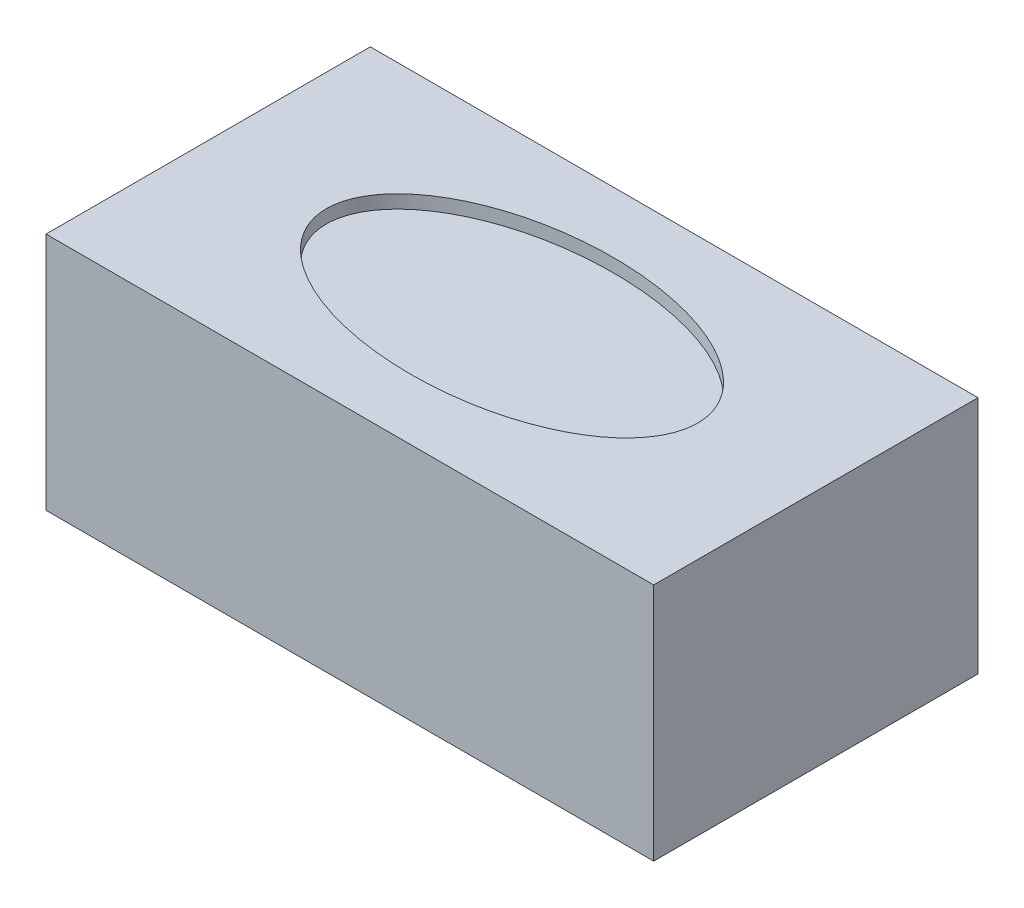
ISO-10303-21;
HEADER;
FILE_DESCRIPTION(('STEP AP214'),'2;1');
FILE_NAME('part.step','',(''),(''),'','','');
FILE_SCHEMA(('AUTOMOTIVE_DESIGN { 1 0 10303 214 1 1 1 1 }'));
ENDSEC;
DATA;
#1=APPLICATION_CONTEXT('core data for automotive mechanical design processes');
#2=APPLICATION_PROTOCOL_DEFINITION('international standard','automotive_design',2000,#1);
#3=PRODUCT_CONTEXT('',#1,'mechanical');
#4=PRODUCT('Part','Part','',(#3));
#5=PRODUCT_RELATED_PRODUCT_CATEGORY('part','',(#4));
#6=PRODUCT_DEFINITION_FORMATION('','',#4);
#7=PRODUCT_DEFINITION_CONTEXT('part definition',#1,'design');
#8=PRODUCT_DEFINITION('design','',#6,#7);
#9=PRODUCT_DEFINITION_SHAPE('','',#8);
#10=(LENGTH_UNIT() NAMED_UNIT(*) SI_UNIT(.MILLI.,.METRE.));
#11=(NAMED_UNIT(*) PLANE_ANGLE_UNIT() SI_UNIT($,.RADIAN.));
#12=(NAMED_UNIT(*) SI_UNIT($,.STERADIAN.) SOLID_ANGLE_UNIT());
#13=UNCERTAINTY_MEASURE_WITH_UNIT(LENGTH_MEASURE(1.E-05),#10,'distance_accuracy_value','');
#14=(GEOMETRIC_REPRESENTATION_CONTEXT(3) GLOBAL_UNCERTAINTY_ASSIGNED_CONTEXT((#13)) GLOBAL_UNIT_ASSIGNED_CONTEXT((#10,
#11,#12)) REPRESENTATION_CONTEXT('',''));
#15=CARTESIAN_POINT('',(0.,0.,0.));
#16=DIRECTION('',(0.,0.,1.));
#17=DIRECTION('',(1.,0.,0.));
#18=AXIS2_PLACEMENT_3D('',#15,#16,#17);
#19=CARTESIAN_POINT('',(114.3,90.,61.));
#20=DIRECTION('',(-1.,0.,0.));
#21=DIRECTION('',(0.,0.,1.));
#22=AXIS2_PLACEMENT_3D('',#19,#20,#21);
#23=PLANE('',#22);
#24=DIRECTION('',(0.,0.,-1.));
#25=VECTOR('',#24,1.);
#26=CARTESIAN_POINT('',(114.3,0.,61.));
#27=LINE('',#26,#25);
#28=CARTESIAN_POINT('',(114.3,0.,61.));
#29=VERTEX_POINT('',#28);
#30=CARTESIAN_POINT('',(114.3,0.,-61.));
#31=VERTEX_POINT('',#30);
#32=EDGE_CURVE('E105',#29,#31,#27,.T.);
#33=ORIENTED_EDGE('',*,*,#32,.T.);
#34=DIRECTION('',(0.,-1.,0.));
#35=VECTOR('',#34,1.);
#36=CARTESIAN_POINT('',(114.3,90.,-61.));
#37=LINE('',#36,#35);
#38=CARTESIAN_POINT('',(114.3,90.,-61.));
#39=VERTEX_POINT('',#38);
#40=EDGE_CURVE('E11',#39,#31,#37,.T.);
#41=ORIENTED_EDGE('',*,*,#40,.F.);
#42=DIRECTION('',(0.,0.,-1.));
#43=VECTOR('',#42,1.);
#44=CARTESIAN_POINT('',(114.3,90.,61.));
#45=LINE('',#44,#43);
#46=CARTESIAN_POINT('',(114.3,90.,61.));
#47=VERTEX_POINT('',#46);
#48=EDGE_CURVE('E89',#47,#39,#45,.T.);
#49=ORIENTED_EDGE('',*,*,#48,.F.);
#50=DIRECTION('',(0.,-1.,0.));
#51=VECTOR('',#50,1.);
#52=CARTESIAN_POINT('',(114.3,90.,61.));
#53=LINE('',#52,#51);
#54=EDGE_CURVE('E98',#47,#29,#53,.T.);
#55=ORIENTED_EDGE('',*,*,#54,.T.);
#56=EDGE_LOOP('',(#33,#41,#49,#55));
#57=FACE_BOUND('',#56,.T.);
#58=ADVANCED_FACE('F39',(#57),#23,.F.);
#59=CARTESIAN_POINT('',(-114.3,90.,-61.));
#60=DIRECTION('',(0.,0.,1.));
#61=DIRECTION('',(1.,0.,0.));
#62=AXIS2_PLACEMENT_3D('',#59,#60,#61);
#63=PLANE('',#62);
#64=DIRECTION('',(-1.,0.,0.));
#65=VECTOR('',#64,1.);
#66=CARTESIAN_POINT('',(-114.3,0.,-61.));
#67=LINE('',#66,#65);
#68=CARTESIAN_POINT('',(-114.3,0.,-61.));
#69=VERTEX_POINT('',#68);
#70=EDGE_CURVE('E94',#31,#69,#67,.T.);
#71=ORIENTED_EDGE('',*,*,#70,.T.);
#72=DIRECTION('',(0.,-1.,0.));
#73=VECTOR('',#72,1.);
#74=CARTESIAN_POINT('',(-114.3,90.,-61.));
#75=LINE('',#74,#73);
#76=CARTESIAN_POINT('',(-114.3,90.,-61.));
#77=VERTEX_POINT('',#76);
#78=EDGE_CURVE('E50',#77,#69,#75,.T.);
#79=ORIENTED_EDGE('',*,*,#78,.F.);
#80=DIRECTION('',(-1.,0.,0.));
#81=VECTOR('',#80,1.);
#82=CARTESIAN_POINT('',(-114.3,90.,-61.));
#83=LINE('',#82,#81);
#84=EDGE_CURVE('E83',#39,#77,#83,.T.);
#85=ORIENTED_EDGE('',*,*,#84,.F.);
#86=ORIENTED_EDGE('',*,*,#40,.T.);
#87=EDGE_LOOP('',(#71,#79,#85,#86));
#88=FACE_BOUND('',#87,.T.);
#89=ADVANCED_FACE('F91',(#88),#63,.F.);
#90=CARTESIAN_POINT('',(-114.3,90.,61.));
#91=DIRECTION('',(1.,0.,0.));
#92=DIRECTION('',(0.,0.,-1.));
#93=AXIS2_PLACEMENT_3D('',#90,#91,#92);
#94=PLANE('',#93);
#95=DIRECTION('',(0.,0.,1.));
#96=VECTOR('',#95,1.);
#97=CARTESIAN_POINT('',(-114.3,0.,61.));
#98=LINE('',#97,#96);
#99=CARTESIAN_POINT('',(-114.3,0.,61.));
#100=VERTEX_POINT('',#99);
#101=EDGE_CURVE('E75',#69,#100,#98,.T.);
#102=ORIENTED_EDGE('',*,*,#101,.T.);
#103=DIRECTION('',(0.,-1.,0.));
#104=VECTOR('',#103,1.);
#105=CARTESIAN_POINT('',(-114.3,90.,61.));
#106=LINE('',#105,#104);
#107=CARTESIAN_POINT('',(-114.3,90.,61.));
#108=VERTEX_POINT('',#107);
#109=EDGE_CURVE('E92',#108,#100,#106,.T.);
#110=ORIENTED_EDGE('',*,*,#109,.F.);
#111=DIRECTION('',(0.,0.,1.));
#112=VECTOR('',#111,1.);
#113=CARTESIAN_POINT('',(-114.3,90.,61.));
#114=LINE('',#113,#112);
#115=EDGE_CURVE('E86',#77,#108,#114,.T.);
#116=ORIENTED_EDGE('',*,*,#115,.F.);
#117=ORIENTED_EDGE('',*,*,#78,.T.);
#118=EDGE_LOOP('',(#102,#110,#116,#117));
#119=FACE_BOUND('',#118,.T.);
#120=ADVANCED_FACE('F96',(#119),#94,.F.);
#121=CARTESIAN_POINT('',(-114.3,90.,61.));
#122=DIRECTION('',(0.,0.,-1.));
#123=DIRECTION('',(-1.,0.,0.));
#124=AXIS2_PLACEMENT_3D('',#121,#122,#123);
#125=PLANE('',#124);
#126=DIRECTION('',(1.,0.,0.));
#127=VECTOR('',#126,1.);
#128=CARTESIAN_POINT('',(-114.3,0.,61.));
#129=LINE('',#128,#127);
#130=EDGE_CURVE('E79',#100,#29,#129,.T.);
#131=ORIENTED_EDGE('',*,*,#130,.T.);
#132=ORIENTED_EDGE('',*,*,#54,.F.);
#133=DIRECTION('',(1.,0.,0.));
#134=VECTOR('',#133,1.);
#135=CARTESIAN_POINT('',(-114.3,90.,61.));
#136=LINE('',#135,#134);
#137=EDGE_CURVE('E54',#108,#47,#136,.T.);
#138=ORIENTED_EDGE('',*,*,#137,.F.);
#139=ORIENTED_EDGE('',*,*,#109,.T.);
#140=EDGE_LOOP('',(#131,#132,#138,#139));
#141=FACE_BOUND('',#140,.T.);
#142=ADVANCED_FACE('F109',(#141),#125,.F.);
#143=CARTESIAN_POINT('',(0.,90.,0.));
#144=DIRECTION('',(0.,-1.,0.));
#145=DIRECTION('',(0.,0.,-1.));
#146=AXIS2_PLACEMENT_3D('',#143,#144,#145);
#147=PLANE('',#146);
#148=CARTESIAN_POINT('',(0.,90.,0.));
#149=DIRECTION('',(0.,1.,0.));
#150=DIRECTION('',(-1.,0.,0.));
#151=AXIS2_PLACEMENT_3D('',#148,#149,#150);
#152=ELLIPSE('',#151,69.85,38.1);
#153=CARTESIAN_POINT('',(-69.85,90.,0.));
#154=VERTEX_POINT('',#153);
#155=EDGE_CURVE('E117',#154,#154,#152,.T.);
#156=ORIENTED_EDGE('',*,*,#155,.F.);
#157=EDGE_LOOP('',(#156));
#158=FACE_BOUND('',#157,.T.);
#159=ORIENTED_EDGE('',*,*,#48,.T.);
#160=ORIENTED_EDGE('',*,*,#84,.T.);
#161=ORIENTED_EDGE('',*,*,#115,.T.);
#162=ORIENTED_EDGE('',*,*,#137,.T.);
#163=EDGE_LOOP('',(#159,#160,#161,#162));
#164=FACE_BOUND('',#163,.T.);
#165=ADVANCED_FACE('F88',(#158,#164),#147,.F.);
#166=CARTESIAN_POINT('',(0.,0.,0.));
#167=DIRECTION('',(0.,-1.,0.));
#168=DIRECTION('',(0.,0.,-1.));
#169=AXIS2_PLACEMENT_3D('',#166,#167,#168);
#170=PLANE('',#169);
#171=ORIENTED_EDGE('',*,*,#32,.F.);
#172=ORIENTED_EDGE('',*,*,#130,.F.);
#173=ORIENTED_EDGE('',*,*,#101,.F.);
#174=ORIENTED_EDGE('',*,*,#70,.F.);
#175=EDGE_LOOP('',(#171,#172,#173,#174));
#176=FACE_BOUND('',#175,.T.);
#177=ADVANCED_FACE('F114',(#176),#170,.T.);
#178=CARTESIAN_POINT('',(0.,85.,0.));
#179=DIRECTION('',(0.,1.,0.));
#180=DIRECTION('',(-1.,0.,0.));
#181=AXIS2_PLACEMENT_3D('',#178,#179,#180);
#182=ELLIPSE('',#181,69.85,38.1);
#183=DIRECTION('',(0.,1.,0.));
#184=VECTOR('',#183,1.);
#185=SURFACE_OF_LINEAR_EXTRUSION('',#182,#184);
#186=CARTESIAN_POINT('',(-69.85,85.,0.));
#187=VERTEX_POINT('',#186);
#188=EDGE_CURVE('E104',#187,#187,#182,.T.);
#189=ORIENTED_EDGE('',*,*,#188,.F.);
#190=EDGE_LOOP('',(#189));
#191=FACE_BOUND('',#190,.T.);
#192=ORIENTED_EDGE('',*,*,#155,.T.);
#193=EDGE_LOOP('',(#192));
#194=FACE_BOUND('',#193,.T.);
#195=ADVANCED_FACE('F125',(#191,#194),#185,.F.);
#196=CARTESIAN_POINT('',(0.,85.,0.));
#197=DIRECTION('',(0.,1.,0.));
#198=DIRECTION('',(0.,0.,1.));
#199=AXIS2_PLACEMENT_3D('',#196,#197,#198);
#200=PLANE('',#199);
#201=ORIENTED_EDGE('',*,*,#188,.T.);
#202=EDGE_LOOP('',(#201));
#203=FACE_BOUND('',#202,.T.);
#204=ADVANCED_FACE('F127',(#203),#200,.T.);
#205=CLOSED_SHELL('',(#58,#89,#120,#142,#165,#177,#195,#204));
#206=MANIFOLD_SOLID_BREP('B2',#205);
#207=ADVANCED_BREP_SHAPE_REPRESENTATION('',(#18,#206),#14);
#208=SHAPE_DEFINITION_REPRESENTATION(#9,#207);
ENDSEC;
END-ISO-10303-21;
